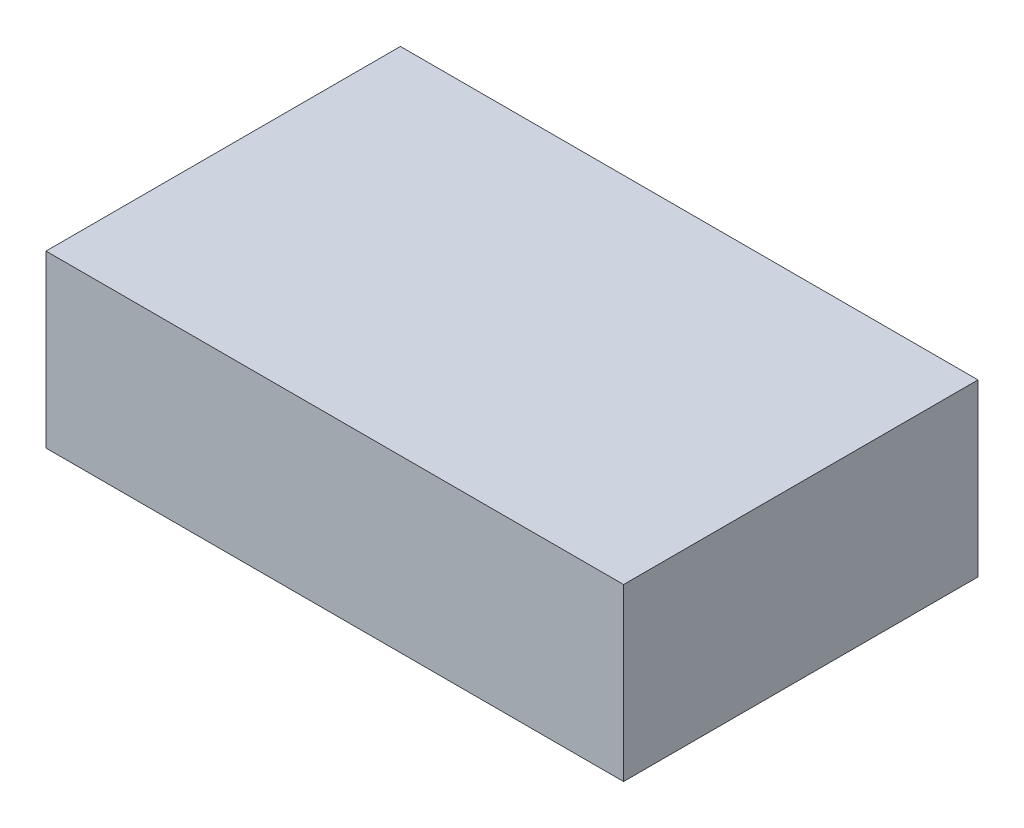
ISO-10303-21;
HEADER;
FILE_DESCRIPTION(('STEP AP214'),'2;1');
FILE_NAME('part.step','',(''),(''),'','','');
FILE_SCHEMA(('AUTOMOTIVE_DESIGN { 1 0 10303 214 1 1 1 1 }'));
ENDSEC;
DATA;
#1=APPLICATION_CONTEXT('core data for automotive mechanical design processes');
#2=APPLICATION_PROTOCOL_DEFINITION('international standard','automotive_design',2000,#1);
#3=PRODUCT_CONTEXT('',#1,'mechanical');
#4=PRODUCT('Part','Part','',(#3));
#5=PRODUCT_RELATED_PRODUCT_CATEGORY('part','',(#4));
#6=PRODUCT_DEFINITION_FORMATION('','',#4);
#7=PRODUCT_DEFINITION_CONTEXT('part definition',#1,'design');
#8=PRODUCT_DEFINITION('design','',#6,#7);
#9=PRODUCT_DEFINITION_SHAPE('','',#8);
#10=(LENGTH_UNIT() NAMED_UNIT(*) SI_UNIT(.MILLI.,.METRE.));
#11=(NAMED_UNIT(*) PLANE_ANGLE_UNIT() SI_UNIT($,.RADIAN.));
#12=(NAMED_UNIT(*) SI_UNIT($,.STERADIAN.) SOLID_ANGLE_UNIT());
#13=UNCERTAINTY_MEASURE_WITH_UNIT(LENGTH_MEASURE(1.E-05),#10,'distance_accuracy_value','');
#14=(GEOMETRIC_REPRESENTATION_CONTEXT(3) GLOBAL_UNCERTAINTY_ASSIGNED_CONTEXT((#13)) GLOBAL_UNIT_ASSIGNED_CONTEXT((#10,
#11,#12)) REPRESENTATION_CONTEXT('',''));
#15=CARTESIAN_POINT('',(0.,0.,0.));
#16=DIRECTION('',(0.,0.,1.));
#17=DIRECTION('',(1.,0.,0.));
#18=AXIS2_PLACEMENT_3D('',#15,#16,#17);
#19=CARTESIAN_POINT('',(-1.1,0.7,-0.675));
#20=DIRECTION('',(1.,0.,0.));
#21=DIRECTION('',(0.,0.,-1.));
#22=AXIS2_PLACEMENT_3D('',#19,#20,#21);
#23=PLANE('',#22);
#24=DIRECTION('',(0.,-1.,0.));
#25=VECTOR('',#24,1.);
#26=CARTESIAN_POINT('',(-1.1,0.7,-0.675));
#27=LINE('',#26,#25);
#28=CARTESIAN_POINT('',(-1.1,0.7,-0.675));
#29=VERTEX_POINT('',#28);
#30=CARTESIAN_POINT('',(-1.1,0.05,-0.675));
#31=VERTEX_POINT('',#30);
#32=EDGE_CURVE('E11',#29,#31,#27,.T.);
#33=ORIENTED_EDGE('',*,*,#32,.T.);
#34=DIRECTION('',(0.,0.,1.));
#35=VECTOR('',#34,1.);
#36=CARTESIAN_POINT('',(-1.1,0.05,-0.675));
#37=LINE('',#36,#35);
#38=CARTESIAN_POINT('',(-1.1,0.05,0.675));
#39=VERTEX_POINT('',#38);
#40=EDGE_CURVE('E24',#31,#39,#37,.T.);
#41=ORIENTED_EDGE('',*,*,#40,.T.);
#42=DIRECTION('',(0.,-1.,0.));
#43=VECTOR('',#42,1.);
#44=CARTESIAN_POINT('',(-1.1,0.7,0.675));
#45=LINE('',#44,#43);
#46=CARTESIAN_POINT('',(-1.1,0.7,0.675));
#47=VERTEX_POINT('',#46);
#48=EDGE_CURVE('E86',#47,#39,#45,.T.);
#49=ORIENTED_EDGE('',*,*,#48,.F.);
#50=DIRECTION('',(0.,0.,1.));
#51=VECTOR('',#50,1.);
#52=CARTESIAN_POINT('',(-1.1,0.7,-0.675));
#53=LINE('',#52,#51);
#54=EDGE_CURVE('E84',#29,#47,#53,.T.);
#55=ORIENTED_EDGE('',*,*,#54,.F.);
#56=EDGE_LOOP('',(#33,#41,#49,#55));
#57=FACE_BOUND('',#56,.T.);
#58=ADVANCED_FACE('F17',(#57),#23,.F.);
#59=CARTESIAN_POINT('',(1.1,0.7,0.675));
#60=DIRECTION('',(0.,0.,-1.));
#61=DIRECTION('',(-1.,0.,0.));
#62=AXIS2_PLACEMENT_3D('',#59,#60,#61);
#63=PLANE('',#62);
#64=ORIENTED_EDGE('',*,*,#48,.T.);
#65=DIRECTION('',(-1.,0.,0.));
#66=VECTOR('',#65,1.);
#67=CARTESIAN_POINT('',(-1.1,0.05,0.675));
#68=LINE('',#67,#66);
#69=CARTESIAN_POINT('',(1.1,0.05,0.675));
#70=VERTEX_POINT('',#69);
#71=EDGE_CURVE('E81',#70,#39,#68,.T.);
#72=ORIENTED_EDGE('',*,*,#71,.F.);
#73=DIRECTION('',(0.,-1.,0.));
#74=VECTOR('',#73,1.);
#75=CARTESIAN_POINT('',(1.1,0.7,0.675));
#76=LINE('',#75,#74);
#77=CARTESIAN_POINT('',(1.1,0.7,0.675));
#78=VERTEX_POINT('',#77);
#79=EDGE_CURVE('E79',#78,#70,#76,.T.);
#80=ORIENTED_EDGE('',*,*,#79,.F.);
#81=DIRECTION('',(1.,0.,0.));
#82=VECTOR('',#81,1.);
#83=CARTESIAN_POINT('',(1.1,0.7,0.675));
#84=LINE('',#83,#82);
#85=EDGE_CURVE('E70',#47,#78,#84,.T.);
#86=ORIENTED_EDGE('',*,*,#85,.F.);
#87=EDGE_LOOP('',(#64,#72,#80,#86));
#88=FACE_BOUND('',#87,.T.);
#89=ADVANCED_FACE('F90',(#88),#63,.F.);
#90=CARTESIAN_POINT('',(1.1,0.7,-0.675));
#91=DIRECTION('',(-1.,0.,0.));
#92=DIRECTION('',(0.,0.,1.));
#93=AXIS2_PLACEMENT_3D('',#90,#91,#92);
#94=PLANE('',#93);
#95=ORIENTED_EDGE('',*,*,#79,.T.);
#96=DIRECTION('',(0.,0.,1.));
#97=VECTOR('',#96,1.);
#98=CARTESIAN_POINT('',(1.1,0.05,-0.675));
#99=LINE('',#98,#97);
#100=CARTESIAN_POINT('',(1.1,0.05,-0.675));
#101=VERTEX_POINT('',#100);
#102=EDGE_CURVE('E60',#101,#70,#99,.T.);
#103=ORIENTED_EDGE('',*,*,#102,.F.);
#104=DIRECTION('',(0.,-1.,0.));
#105=VECTOR('',#104,1.);
#106=CARTESIAN_POINT('',(1.1,0.7,-0.675));
#107=LINE('',#106,#105);
#108=CARTESIAN_POINT('',(1.1,0.7,-0.675));
#109=VERTEX_POINT('',#108);
#110=EDGE_CURVE('E54',#109,#101,#107,.T.);
#111=ORIENTED_EDGE('',*,*,#110,.F.);
#112=DIRECTION('',(0.,0.,-1.));
#113=VECTOR('',#112,1.);
#114=CARTESIAN_POINT('',(1.1,0.7,-0.675));
#115=LINE('',#114,#113);
#116=EDGE_CURVE('E58',#78,#109,#115,.T.);
#117=ORIENTED_EDGE('',*,*,#116,.F.);
#118=EDGE_LOOP('',(#95,#103,#111,#117));
#119=FACE_BOUND('',#118,.T.);
#120=ADVANCED_FACE('F57',(#119),#94,.F.);
#121=CARTESIAN_POINT('',(1.1,0.7,-0.675));
#122=DIRECTION('',(0.,0.,1.));
#123=DIRECTION('',(1.,0.,0.));
#124=AXIS2_PLACEMENT_3D('',#121,#122,#123);
#125=PLANE('',#124);
#126=ORIENTED_EDGE('',*,*,#110,.T.);
#127=DIRECTION('',(-1.,0.,0.));
#128=VECTOR('',#127,1.);
#129=CARTESIAN_POINT('',(-1.1,0.05,-0.675));
#130=LINE('',#129,#128);
#131=EDGE_CURVE('E71',#101,#31,#130,.T.);
#132=ORIENTED_EDGE('',*,*,#131,.T.);
#133=ORIENTED_EDGE('',*,*,#32,.F.);
#134=DIRECTION('',(-1.,0.,0.));
#135=VECTOR('',#134,1.);
#136=CARTESIAN_POINT('',(1.1,0.7,-0.675));
#137=LINE('',#136,#135);
#138=EDGE_CURVE('E68',#109,#29,#137,.T.);
#139=ORIENTED_EDGE('',*,*,#138,.F.);
#140=EDGE_LOOP('',(#126,#132,#133,#139));
#141=FACE_BOUND('',#140,.T.);
#142=ADVANCED_FACE('F73',(#141),#125,.F.);
#143=CARTESIAN_POINT('',(-1.1,0.7,0.675));
#144=DIRECTION('',(0.,-1.,0.));
#145=DIRECTION('',(0.,0.,-1.));
#146=AXIS2_PLACEMENT_3D('',#143,#144,#145);
#147=PLANE('',#146);
#148=ORIENTED_EDGE('',*,*,#54,.T.);
#149=ORIENTED_EDGE('',*,*,#85,.T.);
#150=ORIENTED_EDGE('',*,*,#116,.T.);
#151=ORIENTED_EDGE('',*,*,#138,.T.);
#152=EDGE_LOOP('',(#148,#149,#150,#151));
#153=FACE_BOUND('',#152,.T.);
#154=ADVANCED_FACE('F67',(#153),#147,.F.);
#155=CARTESIAN_POINT('',(-1.1,0.05,-0.675));
#156=DIRECTION('',(0.,1.,0.));
#157=DIRECTION('',(-1.,0.,0.));
#158=AXIS2_PLACEMENT_3D('',#155,#156,#157);
#159=PLANE('',#158);
#160=ORIENTED_EDGE('',*,*,#71,.T.);
#161=ORIENTED_EDGE('',*,*,#40,.F.);
#162=ORIENTED_EDGE('',*,*,#131,.F.);
#163=ORIENTED_EDGE('',*,*,#102,.T.);
#164=EDGE_LOOP('',(#160,#161,#162,#163));
#165=FACE_BOUND('',#164,.T.);
#166=ADVANCED_FACE('F91',(#165),#159,.F.);
#167=CLOSED_SHELL('',(#58,#89,#120,#142,#154,#166));
#168=MANIFOLD_SOLID_BREP('B1',#167);
#169=ADVANCED_BREP_SHAPE_REPRESENTATION('',(#18,#168),#14);
#170=SHAPE_DEFINITION_REPRESENTATION(#9,#169);
ENDSEC;
END-ISO-10303-21;
